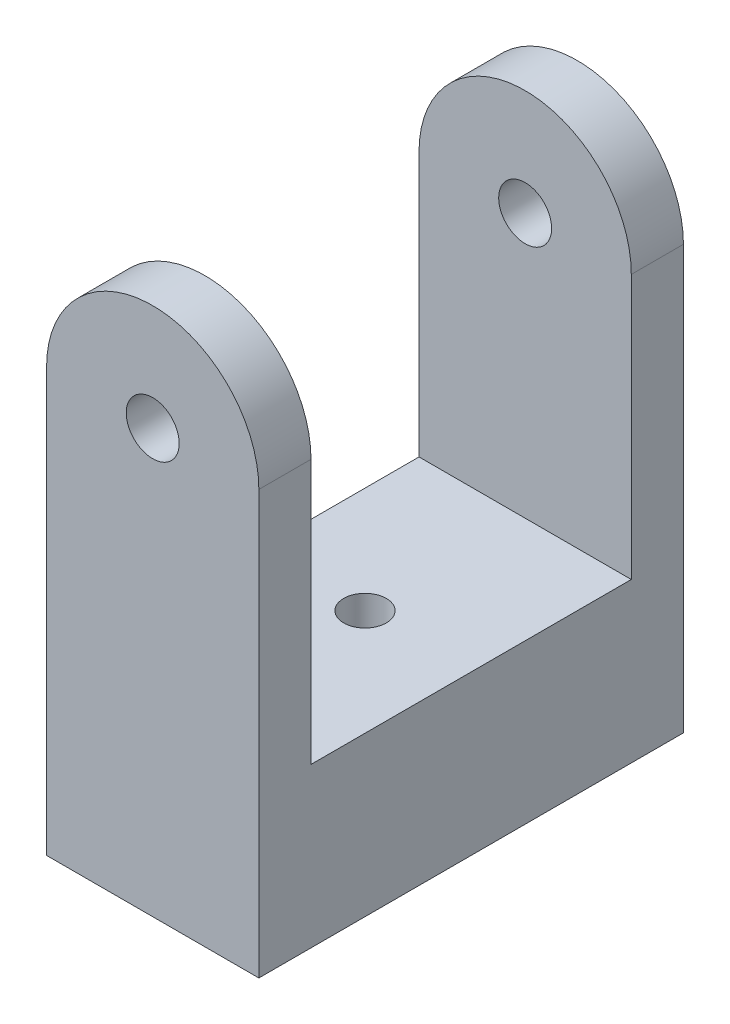
ISO-10303-21;
HEADER;
FILE_DESCRIPTION(('STEP AP214'),'2;1');
FILE_NAME('part.step','',(''),(''),'','','');
FILE_SCHEMA(('AUTOMOTIVE_DESIGN { 1 0 10303 214 1 1 1 1 }'));
ENDSEC;
DATA;
#1=APPLICATION_CONTEXT('core data for automotive mechanical design processes');
#2=APPLICATION_PROTOCOL_DEFINITION('international standard','automotive_design',2000,#1);
#3=PRODUCT_CONTEXT('',#1,'mechanical');
#4=PRODUCT('Part','Part','',(#3));
#5=PRODUCT_RELATED_PRODUCT_CATEGORY('part','',(#4));
#6=PRODUCT_DEFINITION_FORMATION('','',#4);
#7=PRODUCT_DEFINITION_CONTEXT('part definition',#1,'design');
#8=PRODUCT_DEFINITION('design','',#6,#7);
#9=PRODUCT_DEFINITION_SHAPE('','',#8);
#10=(LENGTH_UNIT() NAMED_UNIT(*) SI_UNIT(.MILLI.,.METRE.));
#11=(NAMED_UNIT(*) PLANE_ANGLE_UNIT() SI_UNIT($,.RADIAN.));
#12=(NAMED_UNIT(*) SI_UNIT($,.STERADIAN.) SOLID_ANGLE_UNIT());
#13=UNCERTAINTY_MEASURE_WITH_UNIT(LENGTH_MEASURE(1.E-05),#10,'distance_accuracy_value','');
#14=(GEOMETRIC_REPRESENTATION_CONTEXT(3) GLOBAL_UNCERTAINTY_ASSIGNED_CONTEXT((#13)) GLOBAL_UNIT_ASSIGNED_CONTEXT((#10,
#11,#12)) REPRESENTATION_CONTEXT('',''));
#15=CARTESIAN_POINT('',(0.,0.,0.));
#16=DIRECTION('',(0.,0.,1.));
#17=DIRECTION('',(1.,0.,0.));
#18=AXIS2_PLACEMENT_3D('',#15,#16,#17);
#19=CARTESIAN_POINT('',(-4.28490716489145,14.0051155875148,50.9));
#20=DIRECTION('',(0.,0.,-1.));
#21=DIRECTION('',(-1.,0.,0.));
#22=AXIS2_PLACEMENT_3D('',#19,#20,#21);
#23=CYLINDRICAL_SURFACE('',#22,12.725);
#24=DIRECTION('',(0.,0.,-1.));
#25=VECTOR('',#24,1.);
#26=CARTESIAN_POINT('',(8.44009283510855,14.0051155875148,50.9));
#27=LINE('',#26,#25);
#28=CARTESIAN_POINT('',(8.44009283510855,14.0051155875148,50.9));
#29=VERTEX_POINT('',#28);
#30=CARTESIAN_POINT('',(8.44009283510855,14.0051155875148,44.65));
#31=VERTEX_POINT('',#30);
#32=EDGE_CURVE('E174',#29,#31,#27,.T.);
#33=ORIENTED_EDGE('',*,*,#32,.T.);
#34=CARTESIAN_POINT('',(-4.28490716489145,14.0051155875148,44.65));
#35=DIRECTION('',(0.,0.,1.));
#36=DIRECTION('',(1.,0.,0.));
#37=AXIS2_PLACEMENT_3D('',#34,#35,#36);
#38=CIRCLE('',#37,12.725);
#39=CARTESIAN_POINT('',(-17.0099071648915,14.0051155875148,44.65));
#40=VERTEX_POINT('',#39);
#41=EDGE_CURVE('E151',#31,#40,#38,.T.);
#42=ORIENTED_EDGE('',*,*,#41,.T.);
#43=DIRECTION('',(0.,0.,-1.));
#44=VECTOR('',#43,1.);
#45=CARTESIAN_POINT('',(-17.0099071648915,14.0051155875148,50.9));
#46=LINE('',#45,#44);
#47=CARTESIAN_POINT('',(-17.0099071648915,14.0051155875148,50.9));
#48=VERTEX_POINT('',#47);
#49=EDGE_CURVE('E134',#48,#40,#46,.T.);
#50=ORIENTED_EDGE('',*,*,#49,.F.);
#51=CARTESIAN_POINT('',(-4.28490716489145,14.0051155875148,50.9));
#52=DIRECTION('',(0.,0.,1.));
#53=DIRECTION('',(1.,0.,0.));
#54=AXIS2_PLACEMENT_3D('',#51,#52,#53);
#55=CIRCLE('',#54,12.725);
#56=EDGE_CURVE('E56',#29,#48,#55,.T.);
#57=ORIENTED_EDGE('',*,*,#56,.F.);
#58=EDGE_LOOP('',(#33,#42,#50,#57));
#59=FACE_BOUND('',#58,.T.);
#60=ADVANCED_FACE('F37',(#59),#23,.T.);
#61=CARTESIAN_POINT('',(-4.28490716489145,14.0051155875148,50.9));
#62=DIRECTION('',(0.,0.,-1.));
#63=DIRECTION('',(-1.,0.,0.));
#64=AXIS2_PLACEMENT_3D('',#61,#62,#63);
#65=CYLINDRICAL_SURFACE('',#64,3.175);
#66=CARTESIAN_POINT('',(-4.28490716489145,14.0051155875148,44.65));
#67=DIRECTION('',(0.,0.,1.));
#68=DIRECTION('',(1.,0.,0.));
#69=AXIS2_PLACEMENT_3D('',#66,#67,#68);
#70=CIRCLE('',#69,3.175);
#71=CARTESIAN_POINT('',(-1.10990716489145,14.0051155875148,44.65));
#72=VERTEX_POINT('',#71);
#73=EDGE_CURVE('E41',#72,#72,#70,.T.);
#74=ORIENTED_EDGE('',*,*,#73,.F.);
#75=EDGE_LOOP('',(#74));
#76=FACE_BOUND('',#75,.T.);
#77=CARTESIAN_POINT('',(-4.28490716489145,14.0051155875148,50.9));
#78=DIRECTION('',(0.,0.,1.));
#79=DIRECTION('',(1.,0.,0.));
#80=AXIS2_PLACEMENT_3D('',#77,#78,#79);
#81=CIRCLE('',#80,3.175);
#82=CARTESIAN_POINT('',(-1.10990716489145,14.0051155875148,50.9));
#83=VERTEX_POINT('',#82);
#84=EDGE_CURVE('E154',#83,#83,#81,.T.);
#85=ORIENTED_EDGE('',*,*,#84,.T.);
#86=EDGE_LOOP('',(#85));
#87=FACE_BOUND('',#86,.T.);
#88=ADVANCED_FACE('F189',(#76,#87),#65,.F.);
#89=CARTESIAN_POINT('',(-4.28490716489145,14.0051155875148,50.9));
#90=DIRECTION('',(0.,0.,1.));
#91=DIRECTION('',(1.,0.,0.));
#92=AXIS2_PLACEMENT_3D('',#89,#90,#91);
#93=PLANE('',#92);
#94=DIRECTION('',(0.,-1.,0.));
#95=VECTOR('',#94,1.);
#96=CARTESIAN_POINT('',(-17.0099071648915,14.0051155875148,50.9));
#97=LINE('',#96,#95);
#98=CARTESIAN_POINT('',(-17.0099071648915,-36.7198844124852,50.9));
#99=VERTEX_POINT('',#98);
#100=EDGE_CURVE('E160',#48,#99,#97,.T.);
#101=ORIENTED_EDGE('',*,*,#100,.T.);
#102=DIRECTION('',(1.,0.,0.));
#103=VECTOR('',#102,1.);
#104=CARTESIAN_POINT('',(-17.0099071648915,-36.7198844124852,50.9));
#105=LINE('',#104,#103);
#106=CARTESIAN_POINT('',(8.44009283510855,-36.7198844124852,50.9));
#107=VERTEX_POINT('',#106);
#108=EDGE_CURVE('E88',#99,#107,#105,.T.);
#109=ORIENTED_EDGE('',*,*,#108,.T.);
#110=DIRECTION('',(0.,1.,0.));
#111=VECTOR('',#110,1.);
#112=CARTESIAN_POINT('',(8.44009283510855,-36.7198844124852,50.9));
#113=LINE('',#112,#111);
#114=EDGE_CURVE('E164',#107,#29,#113,.T.);
#115=ORIENTED_EDGE('',*,*,#114,.T.);
#116=ORIENTED_EDGE('',*,*,#56,.T.);
#117=EDGE_LOOP('',(#101,#109,#115,#116));
#118=FACE_BOUND('',#117,.T.);
#119=ORIENTED_EDGE('',*,*,#84,.F.);
#120=EDGE_LOOP('',(#119));
#121=FACE_BOUND('',#120,.T.);
#122=ADVANCED_FACE('F194',(#118,#121),#93,.T.);
#123=CARTESIAN_POINT('',(-4.28490716489145,14.0051155875148,0.));
#124=DIRECTION('',(0.,0.,1.));
#125=DIRECTION('',(1.,0.,0.));
#126=AXIS2_PLACEMENT_3D('',#123,#124,#125);
#127=PLANE('',#126);
#128=DIRECTION('',(0.,-1.,0.));
#129=VECTOR('',#128,1.);
#130=CARTESIAN_POINT('',(-17.0099071648915,14.0051155875148,0.));
#131=LINE('',#130,#129);
#132=CARTESIAN_POINT('',(-17.0099071648915,14.0051155875148,0.));
#133=VERTEX_POINT('',#132);
#134=CARTESIAN_POINT('',(-17.0099071648915,-36.7198844124852,0.));
#135=VERTEX_POINT('',#134);
#136=EDGE_CURVE('E157',#133,#135,#131,.T.);
#137=ORIENTED_EDGE('',*,*,#136,.F.);
#138=CARTESIAN_POINT('',(-4.28490716489145,14.0051155875148,0.));
#139=DIRECTION('',(0.,0.,1.));
#140=DIRECTION('',(1.,0.,0.));
#141=AXIS2_PLACEMENT_3D('',#138,#139,#140);
#142=CIRCLE('',#141,12.725);
#143=CARTESIAN_POINT('',(8.44009283510855,14.0051155875148,0.));
#144=VERTEX_POINT('',#143);
#145=EDGE_CURVE('E162',#144,#133,#142,.T.);
#146=ORIENTED_EDGE('',*,*,#145,.F.);
#147=DIRECTION('',(0.,1.,0.));
#148=VECTOR('',#147,1.);
#149=CARTESIAN_POINT('',(8.44009283510855,-36.7198844124852,0.));
#150=LINE('',#149,#148);
#151=CARTESIAN_POINT('',(8.44009283510855,-36.7198844124852,0.));
#152=VERTEX_POINT('',#151);
#153=EDGE_CURVE('E170',#152,#144,#150,.T.);
#154=ORIENTED_EDGE('',*,*,#153,.F.);
#155=DIRECTION('',(1.,0.,0.));
#156=VECTOR('',#155,1.);
#157=CARTESIAN_POINT('',(-17.0099071648915,-36.7198844124852,0.));
#158=LINE('',#157,#156);
#159=EDGE_CURVE('E168',#135,#152,#158,.T.);
#160=ORIENTED_EDGE('',*,*,#159,.F.);
#161=EDGE_LOOP('',(#137,#146,#154,#160));
#162=FACE_BOUND('',#161,.T.);
#163=CARTESIAN_POINT('',(-4.28490716489145,14.0051155875148,0.));
#164=DIRECTION('',(0.,0.,1.));
#165=DIRECTION('',(1.,0.,0.));
#166=AXIS2_PLACEMENT_3D('',#163,#164,#165);
#167=CIRCLE('',#166,3.175);
#168=CARTESIAN_POINT('',(-1.10990716489145,14.0051155875148,0.));
#169=VERTEX_POINT('',#168);
#170=EDGE_CURVE('E153',#169,#169,#167,.T.);
#171=ORIENTED_EDGE('',*,*,#170,.T.);
#172=EDGE_LOOP('',(#171));
#173=FACE_BOUND('',#172,.T.);
#174=ADVANCED_FACE('F192',(#162,#173),#127,.F.);
#175=CARTESIAN_POINT('',(-17.0099071648915,14.0051155875148,50.9));
#176=DIRECTION('',(1.,0.,0.));
#177=DIRECTION('',(0.,0.,-1.));
#178=AXIS2_PLACEMENT_3D('',#175,#176,#177);
#179=PLANE('',#178);
#180=ORIENTED_EDGE('',*,*,#49,.T.);
#181=DIRECTION('',(0.,-1.,0.));
#182=VECTOR('',#181,1.);
#183=CARTESIAN_POINT('',(-17.0099071648915,26.7301155875148,44.65));
#184=LINE('',#183,#182);
#185=CARTESIAN_POINT('',(-17.0099071648915,-17.6698844124852,44.65));
#186=VERTEX_POINT('',#185);
#187=EDGE_CURVE('E118',#40,#186,#184,.T.);
#188=ORIENTED_EDGE('',*,*,#187,.T.);
#189=DIRECTION('',(0.,0.,-1.));
#190=VECTOR('',#189,1.);
#191=CARTESIAN_POINT('',(-17.0099071648915,-17.6698844124852,44.65));
#192=LINE('',#191,#190);
#193=CARTESIAN_POINT('',(-17.0099071648915,-17.6698844124852,6.25));
#194=VERTEX_POINT('',#193);
#195=EDGE_CURVE('E129',#186,#194,#192,.T.);
#196=ORIENTED_EDGE('',*,*,#195,.T.);
#197=DIRECTION('',(0.,1.,0.));
#198=VECTOR('',#197,1.);
#199=CARTESIAN_POINT('',(-17.0099071648915,26.7301155875148,6.25000000000001));
#200=LINE('',#199,#198);
#201=CARTESIAN_POINT('',(-17.0099071648915,14.0051155875148,6.25));
#202=VERTEX_POINT('',#201);
#203=EDGE_CURVE('E126',#194,#202,#200,.T.);
#204=ORIENTED_EDGE('',*,*,#203,.T.);
#205=EDGE_CURVE('E82',#202,#133,#46,.T.);
#206=ORIENTED_EDGE('',*,*,#205,.T.);
#207=ORIENTED_EDGE('',*,*,#136,.T.);
#208=DIRECTION('',(0.,0.,-1.));
#209=VECTOR('',#208,1.);
#210=CARTESIAN_POINT('',(-17.0099071648915,-36.7198844124852,50.9));
#211=LINE('',#210,#209);
#212=EDGE_CURVE('E11',#99,#135,#211,.T.);
#213=ORIENTED_EDGE('',*,*,#212,.F.);
#214=ORIENTED_EDGE('',*,*,#100,.F.);
#215=EDGE_LOOP('',(#180,#188,#196,#204,#206,#207,#213,#214));
#216=FACE_BOUND('',#215,.T.);
#217=ADVANCED_FACE('F39',(#216),#179,.F.);
#218=CARTESIAN_POINT('',(-17.0099071648915,-36.7198844124852,50.9));
#219=DIRECTION('',(0.,1.,0.));
#220=DIRECTION('',(0.,0.,1.));
#221=AXIS2_PLACEMENT_3D('',#218,#219,#220);
#222=PLANE('',#221);
#223=CARTESIAN_POINT('',(-4.28490716489145,-36.7198844124852,25.45));
#224=DIRECTION('',(0.,-1.,0.));
#225=DIRECTION('',(0.,0.,-1.));
#226=AXIS2_PLACEMENT_3D('',#223,#224,#225);
#227=CIRCLE('',#226,2.5527);
#228=CARTESIAN_POINT('',(-4.28490716489145,-36.7198844124852,22.8973));
#229=VERTEX_POINT('',#228);
#230=EDGE_CURVE('E233',#229,#229,#227,.T.);
#231=ORIENTED_EDGE('',*,*,#230,.F.);
#232=EDGE_LOOP('',(#231));
#233=FACE_BOUND('',#232,.T.);
#234=ORIENTED_EDGE('',*,*,#159,.T.);
#235=DIRECTION('',(0.,0.,-1.));
#236=VECTOR('',#235,1.);
#237=CARTESIAN_POINT('',(8.44009283510855,-36.7198844124852,50.9));
#238=LINE('',#237,#236);
#239=EDGE_CURVE('E47',#107,#152,#238,.T.);
#240=ORIENTED_EDGE('',*,*,#239,.F.);
#241=ORIENTED_EDGE('',*,*,#108,.F.);
#242=ORIENTED_EDGE('',*,*,#212,.T.);
#243=EDGE_LOOP('',(#234,#240,#241,#242));
#244=FACE_BOUND('',#243,.T.);
#245=ADVANCED_FACE('F201',(#233,#244),#222,.F.);
#246=CARTESIAN_POINT('',(8.44009283510855,-36.7198844124852,50.9));
#247=DIRECTION('',(-1.,0.,0.));
#248=DIRECTION('',(0.,0.,1.));
#249=AXIS2_PLACEMENT_3D('',#246,#247,#248);
#250=PLANE('',#249);
#251=DIRECTION('',(0.,0.,-1.));
#252=VECTOR('',#251,1.);
#253=CARTESIAN_POINT('',(8.44009283510855,-17.6698844124852,44.65));
#254=LINE('',#253,#252);
#255=CARTESIAN_POINT('',(8.44009283510855,-17.6698844124852,44.65));
#256=VERTEX_POINT('',#255);
#257=CARTESIAN_POINT('',(8.44009283510855,-17.6698844124852,6.25));
#258=VERTEX_POINT('',#257);
#259=EDGE_CURVE('E138',#256,#258,#254,.T.);
#260=ORIENTED_EDGE('',*,*,#259,.F.);
#261=DIRECTION('',(0.,-1.,0.));
#262=VECTOR('',#261,1.);
#263=CARTESIAN_POINT('',(8.44009283510855,26.7301155875148,44.65));
#264=LINE('',#263,#262);
#265=EDGE_CURVE('E121',#31,#256,#264,.T.);
#266=ORIENTED_EDGE('',*,*,#265,.F.);
#267=ORIENTED_EDGE('',*,*,#32,.F.);
#268=ORIENTED_EDGE('',*,*,#114,.F.);
#269=ORIENTED_EDGE('',*,*,#239,.T.);
#270=ORIENTED_EDGE('',*,*,#153,.T.);
#271=CARTESIAN_POINT('',(8.44009283510855,14.0051155875148,6.25));
#272=VERTEX_POINT('',#271);
#273=EDGE_CURVE('E74',#272,#144,#27,.T.);
#274=ORIENTED_EDGE('',*,*,#273,.F.);
#275=DIRECTION('',(0.,1.,0.));
#276=VECTOR('',#275,1.);
#277=CARTESIAN_POINT('',(8.44009283510855,26.7301155875148,6.25000000000001));
#278=LINE('',#277,#276);
#279=EDGE_CURVE('E135',#258,#272,#278,.T.);
#280=ORIENTED_EDGE('',*,*,#279,.F.);
#281=EDGE_LOOP('',(#260,#266,#267,#268,#269,#270,#274,#280));
#282=FACE_BOUND('',#281,.T.);
#283=ADVANCED_FACE('F213',(#282),#250,.F.);
#284=CARTESIAN_POINT('',(-4.28490716489145,14.0051155875148,6.25000000000001));
#285=DIRECTION('',(0.,0.,-1.));
#286=DIRECTION('',(0.,1.,0.));
#287=AXIS2_PLACEMENT_3D('',#284,#285,#286);
#288=CIRCLE('',#287,12.725);
#289=EDGE_CURVE('E149',#202,#272,#288,.T.);
#290=ORIENTED_EDGE('',*,*,#289,.T.);
#291=ORIENTED_EDGE('',*,*,#273,.T.);
#292=ORIENTED_EDGE('',*,*,#145,.T.);
#293=ORIENTED_EDGE('',*,*,#205,.F.);
#294=EDGE_LOOP('',(#290,#291,#292,#293));
#295=FACE_BOUND('',#294,.T.);
#296=ADVANCED_FACE('F187',(#295),#23,.T.);
#297=CARTESIAN_POINT('',(-4.28490716489145,14.0051155875148,6.25000000000001));
#298=DIRECTION('',(0.,0.,-1.));
#299=DIRECTION('',(0.,1.,0.));
#300=AXIS2_PLACEMENT_3D('',#297,#298,#299);
#301=CIRCLE('',#300,3.175);
#302=CARTESIAN_POINT('',(-4.28490716489145,17.1801155875148,6.25000000000001));
#303=VERTEX_POINT('',#302);
#304=EDGE_CURVE('E147',#303,#303,#301,.T.);
#305=ORIENTED_EDGE('',*,*,#304,.F.);
#306=EDGE_LOOP('',(#305));
#307=FACE_BOUND('',#306,.T.);
#308=ORIENTED_EDGE('',*,*,#170,.F.);
#309=EDGE_LOOP('',(#308));
#310=FACE_BOUND('',#309,.T.);
#311=ADVANCED_FACE('F184',(#307,#310),#65,.F.);
#312=CARTESIAN_POINT('',(-17.0099071648915,26.7301155875148,44.65));
#313=DIRECTION('',(0.,0.,1.));
#314=DIRECTION('',(1.,0.,0.));
#315=AXIS2_PLACEMENT_3D('',#312,#313,#314);
#316=PLANE('',#315);
#317=ORIENTED_EDGE('',*,*,#73,.T.);
#318=EDGE_LOOP('',(#317));
#319=FACE_BOUND('',#318,.T.);
#320=ORIENTED_EDGE('',*,*,#265,.T.);
#321=DIRECTION('',(1.,0.,0.));
#322=VECTOR('',#321,1.);
#323=CARTESIAN_POINT('',(-17.0099071648915,-17.6698844124852,44.65));
#324=LINE('',#323,#322);
#325=EDGE_CURVE('E114',#186,#256,#324,.T.);
#326=ORIENTED_EDGE('',*,*,#325,.F.);
#327=ORIENTED_EDGE('',*,*,#187,.F.);
#328=ORIENTED_EDGE('',*,*,#41,.F.);
#329=EDGE_LOOP('',(#320,#326,#327,#328));
#330=FACE_BOUND('',#329,.T.);
#331=ADVANCED_FACE('F116',(#319,#330),#316,.F.);
#332=CARTESIAN_POINT('',(-17.0099071648915,26.7301155875148,6.25000000000001));
#333=DIRECTION('',(0.,0.,-1.));
#334=DIRECTION('',(0.,1.,0.));
#335=AXIS2_PLACEMENT_3D('',#332,#333,#334);
#336=PLANE('',#335);
#337=ORIENTED_EDGE('',*,*,#304,.T.);
#338=EDGE_LOOP('',(#337));
#339=FACE_BOUND('',#338,.T.);
#340=ORIENTED_EDGE('',*,*,#289,.F.);
#341=ORIENTED_EDGE('',*,*,#203,.F.);
#342=DIRECTION('',(1.,0.,0.));
#343=VECTOR('',#342,1.);
#344=CARTESIAN_POINT('',(-17.0099071648915,-17.6698844124852,6.25));
#345=LINE('',#344,#343);
#346=EDGE_CURVE('E125',#194,#258,#345,.T.);
#347=ORIENTED_EDGE('',*,*,#346,.T.);
#348=ORIENTED_EDGE('',*,*,#279,.T.);
#349=EDGE_LOOP('',(#340,#341,#347,#348));
#350=FACE_BOUND('',#349,.T.);
#351=ADVANCED_FACE('F181',(#339,#350),#336,.F.);
#352=CARTESIAN_POINT('',(-17.0099071648915,-17.6698844124852,44.65));
#353=DIRECTION('',(0.,-1.,0.));
#354=DIRECTION('',(0.,0.,-1.));
#355=AXIS2_PLACEMENT_3D('',#352,#353,#354);
#356=PLANE('',#355);
#357=CARTESIAN_POINT('',(-4.28490716489145,-17.6698844124852,25.45));
#358=DIRECTION('',(0.,-1.,0.));
#359=DIRECTION('',(0.,0.,-1.));
#360=AXIS2_PLACEMENT_3D('',#357,#358,#359);
#361=CIRCLE('',#360,2.5527);
#362=CARTESIAN_POINT('',(-4.28490716489145,-17.6698844124852,22.8973));
#363=VERTEX_POINT('',#362);
#364=EDGE_CURVE('E141',#363,#363,#361,.T.);
#365=ORIENTED_EDGE('',*,*,#364,.T.);
#366=EDGE_LOOP('',(#365));
#367=FACE_BOUND('',#366,.T.);
#368=ORIENTED_EDGE('',*,*,#259,.T.);
#369=ORIENTED_EDGE('',*,*,#346,.F.);
#370=ORIENTED_EDGE('',*,*,#195,.F.);
#371=ORIENTED_EDGE('',*,*,#325,.T.);
#372=EDGE_LOOP('',(#368,#369,#370,#371));
#373=FACE_BOUND('',#372,.T.);
#374=ADVANCED_FACE('F130',(#367,#373),#356,.F.);
#375=CARTESIAN_POINT('',(-4.28490716489145,-36.7198844124852,25.45));
#376=DIRECTION('',(0.,-1.,0.));
#377=DIRECTION('',(0.,0.,-1.));
#378=AXIS2_PLACEMENT_3D('',#375,#376,#377);
#379=CYLINDRICAL_SURFACE('',#378,2.5527);
#380=ORIENTED_EDGE('',*,*,#230,.T.);
#381=EDGE_LOOP('',(#380));
#382=FACE_BOUND('',#381,.T.);
#383=ORIENTED_EDGE('',*,*,#364,.F.);
#384=EDGE_LOOP('',(#383));
#385=FACE_BOUND('',#384,.T.);
#386=ADVANCED_FACE('F239',(#382,#385),#379,.F.);
#387=CLOSED_SHELL('',(#60,#88,#122,#174,#217,#245,#283,#296,#311,#331,#351,#374,#386));
#388=MANIFOLD_SOLID_BREP('B2',#387);
#389=ADVANCED_BREP_SHAPE_REPRESENTATION('',(#18,#388),#14);
#390=SHAPE_DEFINITION_REPRESENTATION(#9,#389);
ENDSEC;
END-ISO-10303-21;
